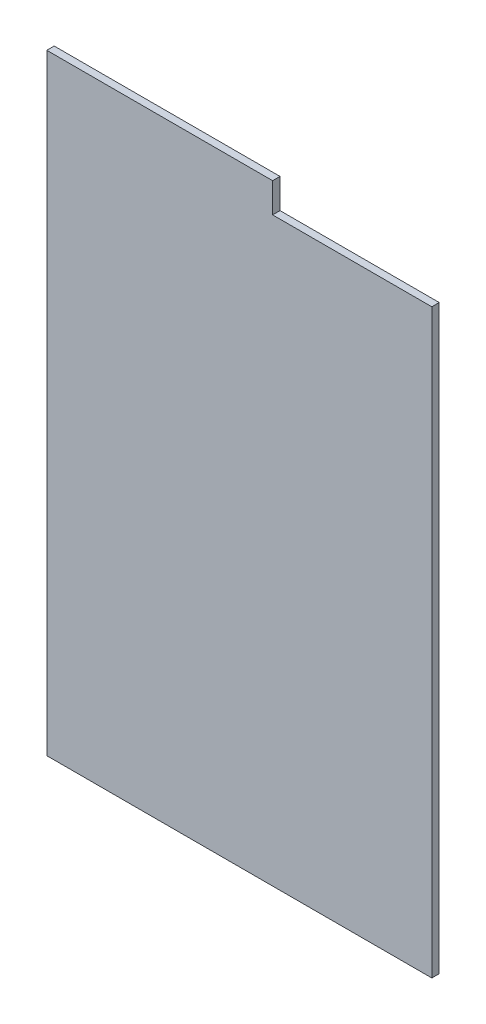
ISO-10303-21;
HEADER;
FILE_DESCRIPTION(('STEP AP214'),'2;1');
FILE_NAME('part.step','',(''),(''),'','','');
FILE_SCHEMA(('AUTOMOTIVE_DESIGN { 1 0 10303 214 1 1 1 1 }'));
ENDSEC;
DATA;
#1=APPLICATION_CONTEXT('core data for automotive mechanical design processes');
#2=APPLICATION_PROTOCOL_DEFINITION('international standard','automotive_design',2000,#1);
#3=PRODUCT_CONTEXT('',#1,'mechanical');
#4=PRODUCT('Part','Part','',(#3));
#5=PRODUCT_RELATED_PRODUCT_CATEGORY('part','',(#4));
#6=PRODUCT_DEFINITION_FORMATION('','',#4);
#7=PRODUCT_DEFINITION_CONTEXT('part definition',#1,'design');
#8=PRODUCT_DEFINITION('design','',#6,#7);
#9=PRODUCT_DEFINITION_SHAPE('','',#8);
#10=(LENGTH_UNIT() NAMED_UNIT(*) SI_UNIT(.MILLI.,.METRE.));
#11=(NAMED_UNIT(*) PLANE_ANGLE_UNIT() SI_UNIT($,.RADIAN.));
#12=(NAMED_UNIT(*) SI_UNIT($,.STERADIAN.) SOLID_ANGLE_UNIT());
#13=UNCERTAINTY_MEASURE_WITH_UNIT(LENGTH_MEASURE(1.E-05),#10,'distance_accuracy_value','');
#14=(GEOMETRIC_REPRESENTATION_CONTEXT(3) GLOBAL_UNCERTAINTY_ASSIGNED_CONTEXT((#13)) GLOBAL_UNIT_ASSIGNED_CONTEXT((#10,
#11,#12)) REPRESENTATION_CONTEXT('',''));
#15=CARTESIAN_POINT('',(0.,0.,0.));
#16=DIRECTION('',(0.,0.,1.));
#17=DIRECTION('',(1.,0.,0.));
#18=AXIS2_PLACEMENT_3D('',#15,#16,#17);
#19=CARTESIAN_POINT('',(2.22044604925032E-13,660.4,88.9));
#20=DIRECTION('',(0.,0.,1.));
#21=DIRECTION('',(1.,0.,0.));
#22=AXIS2_PLACEMENT_3D('',#19,#20,#21);
#23=PLANE('',#22);
#24=DIRECTION('',(0.,1.,0.));
#25=VECTOR('',#24,1.);
#26=CARTESIAN_POINT('',(-660.4,660.4,88.9));
#27=LINE('',#26,#25);
#28=CARTESIAN_POINT('',(-660.4,323.85,88.9));
#29=VERTEX_POINT('',#28);
#30=CARTESIAN_POINT('',(-660.4,1371.6,88.9));
#31=VERTEX_POINT('',#30);
#32=EDGE_CURVE('E9',#29,#31,#27,.T.);
#33=ORIENTED_EDGE('',*,*,#32,.F.);
#34=DIRECTION('',(1.,0.,0.));
#35=VECTOR('',#34,1.);
#36=CARTESIAN_POINT('',(-660.4,323.85,88.9));
#37=LINE('',#36,#35);
#38=CARTESIAN_POINT('',(4.44089209850063E-13,323.85,88.9));
#39=VERTEX_POINT('',#38);
#40=EDGE_CURVE('E106',#29,#39,#37,.T.);
#41=ORIENTED_EDGE('',*,*,#40,.T.);
#42=DIRECTION('',(0.,-1.,0.));
#43=VECTOR('',#42,1.);
#44=CARTESIAN_POINT('',(2.22044604925032E-13,822.325,88.9));
#45=LINE('',#44,#43);
#46=CARTESIAN_POINT('',(0.,1320.8,88.9));
#47=VERTEX_POINT('',#46);
#48=EDGE_CURVE('E116',#47,#39,#45,.T.);
#49=ORIENTED_EDGE('',*,*,#48,.F.);
#50=DIRECTION('',(-1.,0.,0.));
#51=VECTOR('',#50,1.);
#52=CARTESIAN_POINT('',(-136.525,1320.8,88.9));
#53=LINE('',#52,#51);
#54=CARTESIAN_POINT('',(-273.05,1320.8,88.9));
#55=VERTEX_POINT('',#54);
#56=EDGE_CURVE('E101',#47,#55,#53,.T.);
#57=ORIENTED_EDGE('',*,*,#56,.T.);
#58=DIRECTION('',(0.,1.,0.));
#59=VECTOR('',#58,1.);
#60=CARTESIAN_POINT('',(-273.05,1346.2,88.9));
#61=LINE('',#60,#59);
#62=CARTESIAN_POINT('',(-273.05,1371.6,88.9));
#63=VERTEX_POINT('',#62);
#64=EDGE_CURVE('E87',#55,#63,#61,.T.);
#65=ORIENTED_EDGE('',*,*,#64,.T.);
#66=DIRECTION('',(-1.,0.,0.));
#67=VECTOR('',#66,1.);
#68=CARTESIAN_POINT('',(-796.925,1371.6,88.9));
#69=LINE('',#68,#67);
#70=EDGE_CURVE('E99',#63,#31,#69,.T.);
#71=ORIENTED_EDGE('',*,*,#70,.T.);
#72=EDGE_LOOP('',(#33,#41,#49,#57,#65,#71));
#73=FACE_BOUND('',#72,.T.);
#74=ADVANCED_FACE('F14',(#73),#23,.T.);
#75=CARTESIAN_POINT('',(-273.05,1346.2,88.902));
#76=DIRECTION('',(-1.,0.,0.));
#77=DIRECTION('',(0.,0.,1.));
#78=AXIS2_PLACEMENT_3D('',#75,#76,#77);
#79=PLANE('',#78);
#80=ORIENTED_EDGE('',*,*,#64,.F.);
#81=DIRECTION('',(0.,0.,-1.));
#82=VECTOR('',#81,1.);
#83=CARTESIAN_POINT('',(-273.05,1320.8,88.902));
#84=LINE('',#83,#82);
#85=CARTESIAN_POINT('',(-273.05,1320.8,76.2));
#86=VERTEX_POINT('',#85);
#87=EDGE_CURVE('E95',#55,#86,#84,.T.);
#88=ORIENTED_EDGE('',*,*,#87,.T.);
#89=DIRECTION('',(0.,1.,0.));
#90=VECTOR('',#89,1.);
#91=CARTESIAN_POINT('',(-273.05,1346.2,76.2));
#92=LINE('',#91,#90);
#93=CARTESIAN_POINT('',(-273.05,1371.6,76.2));
#94=VERTEX_POINT('',#93);
#95=EDGE_CURVE('E89',#86,#94,#92,.T.);
#96=ORIENTED_EDGE('',*,*,#95,.T.);
#97=DIRECTION('',(0.,0.,-1.));
#98=VECTOR('',#97,1.);
#99=CARTESIAN_POINT('',(-273.05,1371.6,88.902));
#100=LINE('',#99,#98);
#101=EDGE_CURVE('E84',#63,#94,#100,.T.);
#102=ORIENTED_EDGE('',*,*,#101,.F.);
#103=EDGE_LOOP('',(#80,#88,#96,#102));
#104=FACE_BOUND('',#103,.T.);
#105=ADVANCED_FACE('F86',(#104),#79,.F.);
#106=CARTESIAN_POINT('',(-796.925,1371.6,88.902));
#107=DIRECTION('',(0.,-1.,0.));
#108=DIRECTION('',(0.,0.,-1.));
#109=AXIS2_PLACEMENT_3D('',#106,#107,#108);
#110=PLANE('',#109);
#111=DIRECTION('',(-1.,0.,0.));
#112=VECTOR('',#111,1.);
#113=CARTESIAN_POINT('',(-796.925,1371.6,76.2));
#114=LINE('',#113,#112);
#115=CARTESIAN_POINT('',(-660.4,1371.6,76.2));
#116=VERTEX_POINT('',#115);
#117=EDGE_CURVE('E137',#94,#116,#114,.T.);
#118=ORIENTED_EDGE('',*,*,#117,.T.);
#119=DIRECTION('',(0.,0.,1.));
#120=VECTOR('',#119,1.);
#121=CARTESIAN_POINT('',(-660.4,1371.6,88.902));
#122=LINE('',#121,#120);
#123=EDGE_CURVE('E24',#116,#31,#122,.T.);
#124=ORIENTED_EDGE('',*,*,#123,.T.);
#125=ORIENTED_EDGE('',*,*,#70,.F.);
#126=ORIENTED_EDGE('',*,*,#101,.T.);
#127=EDGE_LOOP('',(#118,#124,#125,#126));
#128=FACE_BOUND('',#127,.T.);
#129=ADVANCED_FACE('F104',(#128),#110,.F.);
#130=CARTESIAN_POINT('',(-660.4,847.725,76.2));
#131=DIRECTION('',(0.,0.,1.));
#132=DIRECTION('',(1.,0.,0.));
#133=AXIS2_PLACEMENT_3D('',#130,#131,#132);
#134=PLANE('',#133);
#135=DIRECTION('',(1.,0.,0.));
#136=VECTOR('',#135,1.);
#137=CARTESIAN_POINT('',(-660.4,323.85,76.2));
#138=LINE('',#137,#136);
#139=CARTESIAN_POINT('',(-660.4,323.85,76.2));
#140=VERTEX_POINT('',#139);
#141=CARTESIAN_POINT('',(4.44089209850063E-13,323.85,76.2));
#142=VERTEX_POINT('',#141);
#143=EDGE_CURVE('E129',#140,#142,#138,.T.);
#144=ORIENTED_EDGE('',*,*,#143,.F.);
#145=DIRECTION('',(0.,1.,0.));
#146=VECTOR('',#145,1.);
#147=CARTESIAN_POINT('',(-660.4,847.725,76.2));
#148=LINE('',#147,#146);
#149=EDGE_CURVE('E167',#140,#116,#148,.T.);
#150=ORIENTED_EDGE('',*,*,#149,.T.);
#151=ORIENTED_EDGE('',*,*,#117,.F.);
#152=ORIENTED_EDGE('',*,*,#95,.F.);
#153=DIRECTION('',(-1.,0.,0.));
#154=VECTOR('',#153,1.);
#155=CARTESIAN_POINT('',(-136.525,1320.8,76.2));
#156=LINE('',#155,#154);
#157=CARTESIAN_POINT('',(0.,1320.8,76.2));
#158=VERTEX_POINT('',#157);
#159=EDGE_CURVE('E144',#158,#86,#156,.T.);
#160=ORIENTED_EDGE('',*,*,#159,.F.);
#161=DIRECTION('',(0.,-1.,0.));
#162=VECTOR('',#161,1.);
#163=CARTESIAN_POINT('',(2.22044604925032E-13,822.325,76.2));
#164=LINE('',#163,#162);
#165=EDGE_CURVE('E121',#158,#142,#164,.T.);
#166=ORIENTED_EDGE('',*,*,#165,.T.);
#167=EDGE_LOOP('',(#144,#150,#151,#152,#160,#166));
#168=FACE_BOUND('',#167,.T.);
#169=ADVANCED_FACE('F166',(#168),#134,.F.);
#170=CARTESIAN_POINT('',(-660.4,323.85,88.902));
#171=DIRECTION('',(0.,1.,0.));
#172=DIRECTION('',(0.,0.,1.));
#173=AXIS2_PLACEMENT_3D('',#170,#171,#172);
#174=PLANE('',#173);
#175=ORIENTED_EDGE('',*,*,#40,.F.);
#176=DIRECTION('',(0.,0.,-1.));
#177=VECTOR('',#176,1.);
#178=CARTESIAN_POINT('',(-660.4,323.85,88.902));
#179=LINE('',#178,#177);
#180=EDGE_CURVE('E18',#29,#140,#179,.T.);
#181=ORIENTED_EDGE('',*,*,#180,.T.);
#182=ORIENTED_EDGE('',*,*,#143,.T.);
#183=DIRECTION('',(0.,0.,-1.));
#184=VECTOR('',#183,1.);
#185=CARTESIAN_POINT('',(4.44089209850063E-13,323.85,88.902));
#186=LINE('',#185,#184);
#187=EDGE_CURVE('E94',#39,#142,#186,.T.);
#188=ORIENTED_EDGE('',*,*,#187,.F.);
#189=EDGE_LOOP('',(#175,#181,#182,#188));
#190=FACE_BOUND('',#189,.T.);
#191=ADVANCED_FACE('F163',(#190),#174,.F.);
#192=CARTESIAN_POINT('',(-136.525,1320.8,88.902));
#193=DIRECTION('',(0.,-1.,0.));
#194=DIRECTION('',(0.,0.,-1.));
#195=AXIS2_PLACEMENT_3D('',#192,#193,#194);
#196=PLANE('',#195);
#197=ORIENTED_EDGE('',*,*,#56,.F.);
#198=DIRECTION('',(0.,0.,-1.));
#199=VECTOR('',#198,1.);
#200=CARTESIAN_POINT('',(0.,1320.8,88.902));
#201=LINE('',#200,#199);
#202=EDGE_CURVE('E119',#47,#158,#201,.T.);
#203=ORIENTED_EDGE('',*,*,#202,.T.);
#204=ORIENTED_EDGE('',*,*,#159,.T.);
#205=ORIENTED_EDGE('',*,*,#87,.F.);
#206=EDGE_LOOP('',(#197,#203,#204,#205));
#207=FACE_BOUND('',#206,.T.);
#208=ADVANCED_FACE('F198',(#207),#196,.F.);
#209=CARTESIAN_POINT('',(2.22044604925032E-13,822.325,88.902));
#210=DIRECTION('',(1.,0.,0.));
#211=DIRECTION('',(0.,1.,0.));
#212=AXIS2_PLACEMENT_3D('',#209,#210,#211);
#213=PLANE('',#212);
#214=ORIENTED_EDGE('',*,*,#202,.F.);
#215=ORIENTED_EDGE('',*,*,#48,.T.);
#216=ORIENTED_EDGE('',*,*,#187,.T.);
#217=ORIENTED_EDGE('',*,*,#165,.F.);
#218=EDGE_LOOP('',(#214,#215,#216,#217));
#219=FACE_BOUND('',#218,.T.);
#220=ADVANCED_FACE('F16',(#219),#213,.T.);
#221=CARTESIAN_POINT('',(-660.4,835.025,82.55));
#222=DIRECTION('',(1.,0.,0.));
#223=DIRECTION('',(0.,1.,0.));
#224=AXIS2_PLACEMENT_3D('',#221,#222,#223);
#225=PLANE('',#224);
#226=ORIENTED_EDGE('',*,*,#32,.T.);
#227=ORIENTED_EDGE('',*,*,#123,.F.);
#228=ORIENTED_EDGE('',*,*,#149,.F.);
#229=ORIENTED_EDGE('',*,*,#180,.F.);
#230=EDGE_LOOP('',(#226,#227,#228,#229));
#231=FACE_BOUND('',#230,.T.);
#232=ADVANCED_FACE('F176',(#231),#225,.F.);
#233=CLOSED_SHELL('',(#74,#105,#129,#169,#191,#208,#220,#232));
#234=MANIFOLD_SOLID_BREP('B1',#233);
#235=ADVANCED_BREP_SHAPE_REPRESENTATION('',(#18,#234),#14);
#236=SHAPE_DEFINITION_REPRESENTATION(#9,#235);
ENDSEC;
END-ISO-10303-21;
